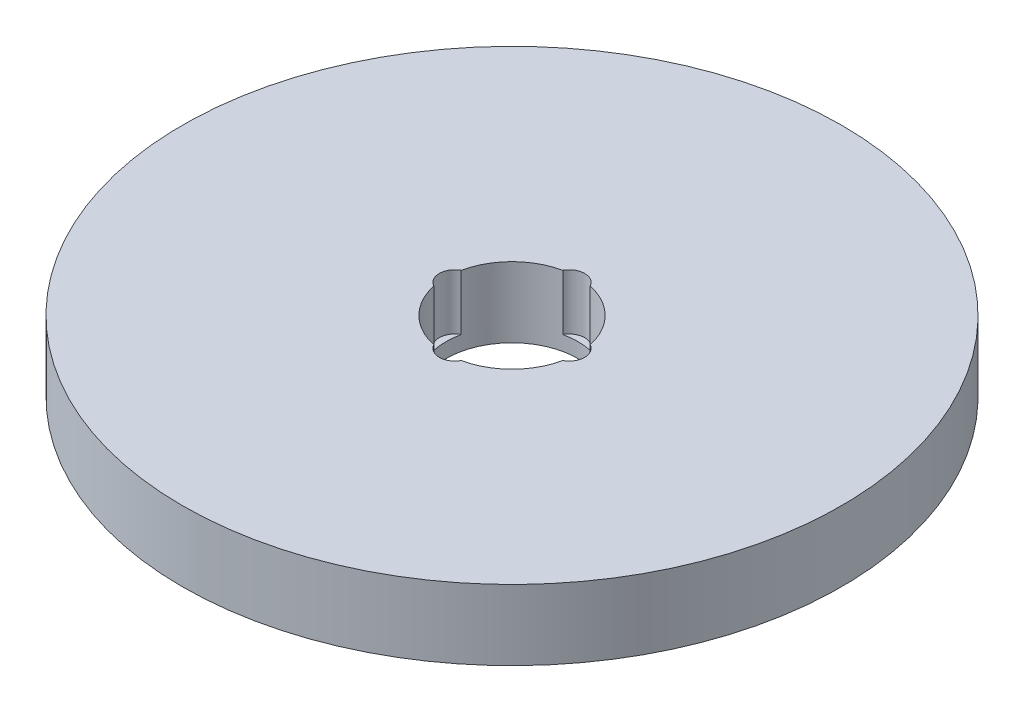
ISO-10303-21;
HEADER;
FILE_DESCRIPTION(('STEP AP214'),'2;1');
FILE_NAME('part.step','',(''),(''),'','','');
FILE_SCHEMA(('AUTOMOTIVE_DESIGN { 1 0 10303 214 1 1 1 1 }'));
ENDSEC;
DATA;
#1=APPLICATION_CONTEXT('core data for automotive mechanical design processes');
#2=APPLICATION_PROTOCOL_DEFINITION('international standard','automotive_design',2000,#1);
#3=PRODUCT_CONTEXT('',#1,'mechanical');
#4=PRODUCT('Part','Part','',(#3));
#5=PRODUCT_RELATED_PRODUCT_CATEGORY('part','',(#4));
#6=PRODUCT_DEFINITION_FORMATION('','',#4);
#7=PRODUCT_DEFINITION_CONTEXT('part definition',#1,'design');
#8=PRODUCT_DEFINITION('design','',#6,#7);
#9=PRODUCT_DEFINITION_SHAPE('','',#8);
#10=(LENGTH_UNIT() NAMED_UNIT(*) SI_UNIT(.MILLI.,.METRE.));
#11=(NAMED_UNIT(*) PLANE_ANGLE_UNIT() SI_UNIT($,.RADIAN.));
#12=(NAMED_UNIT(*) SI_UNIT($,.STERADIAN.) SOLID_ANGLE_UNIT());
#13=UNCERTAINTY_MEASURE_WITH_UNIT(LENGTH_MEASURE(1.E-05),#10,'distance_accuracy_value','');
#14=(GEOMETRIC_REPRESENTATION_CONTEXT(3) GLOBAL_UNCERTAINTY_ASSIGNED_CONTEXT((#13)) GLOBAL_UNIT_ASSIGNED_CONTEXT((#10,
#11,#12)) REPRESENTATION_CONTEXT('',''));
#15=CARTESIAN_POINT('',(0.,0.,0.));
#16=DIRECTION('',(0.,0.,1.));
#17=DIRECTION('',(1.,0.,0.));
#18=AXIS2_PLACEMENT_3D('',#15,#16,#17);
#19=CARTESIAN_POINT('',(0.,8.,0.));
#20=DIRECTION('',(0.,-1.,0.));
#21=DIRECTION('',(0.,0.,-1.));
#22=AXIS2_PLACEMENT_3D('',#19,#20,#21);
#23=CYLINDRICAL_SURFACE('',#22,37.5);
#24=CARTESIAN_POINT('',(0.,8.,0.));
#25=DIRECTION('',(0.,1.,0.));
#26=DIRECTION('',(0.,0.,1.));
#27=AXIS2_PLACEMENT_3D('',#24,#25,#26);
#28=CIRCLE('',#27,37.5);
#29=CARTESIAN_POINT('',(0.,8.,37.5));
#30=VERTEX_POINT('',#29);
#31=EDGE_CURVE('E148',#30,#30,#28,.T.);
#32=ORIENTED_EDGE('',*,*,#31,.F.);
#33=EDGE_LOOP('',(#32));
#34=FACE_BOUND('',#33,.T.);
#35=CARTESIAN_POINT('',(0.,0.,0.));
#36=DIRECTION('',(0.,1.,0.));
#37=DIRECTION('',(0.,0.,1.));
#38=AXIS2_PLACEMENT_3D('',#35,#36,#37);
#39=CIRCLE('',#38,37.5);
#40=CARTESIAN_POINT('',(0.,0.,37.5));
#41=VERTEX_POINT('',#40);
#42=EDGE_CURVE('E139',#41,#41,#39,.T.);
#43=ORIENTED_EDGE('',*,*,#42,.T.);
#44=EDGE_LOOP('',(#43));
#45=FACE_BOUND('',#44,.T.);
#46=ADVANCED_FACE('F39',(#34,#45),#23,.T.);
#47=CARTESIAN_POINT('',(0.,8.,0.));
#48=DIRECTION('',(0.,1.,0.));
#49=DIRECTION('',(0.,0.,1.));
#50=AXIS2_PLACEMENT_3D('',#47,#48,#49);
#51=PLANE('',#50);
#52=CARTESIAN_POINT('',(0.,8.,6.49927386332328));
#53=DIRECTION('',(0.,1.,0.));
#54=DIRECTION('',(1.,0.,0.));
#55=AXIS2_PLACEMENT_3D('',#52,#53,#54);
#56=CIRCLE('',#55,1.77006514991203);
#57=CARTESIAN_POINT('',(-1.55981062752104,8.,7.33600646171147));
#58=VERTEX_POINT('',#57);
#59=CARTESIAN_POINT('',(1.55981062752109,8.,7.33600646171146));
#60=VERTEX_POINT('',#59);
#61=EDGE_CURVE('E175',#58,#60,#56,.T.);
#62=ORIENTED_EDGE('',*,*,#61,.F.);
#63=CARTESIAN_POINT('',(0.,8.,0.));
#64=DIRECTION('',(0.,1.,0.));
#65=DIRECTION('',(0.,0.,1.));
#66=AXIS2_PLACEMENT_3D('',#63,#64,#65);
#67=CIRCLE('',#66,7.5);
#68=CARTESIAN_POINT('',(-7.33600646171146,8.,1.55981062752107));
#69=VERTEX_POINT('',#68);
#70=EDGE_CURVE('E134',#69,#58,#67,.T.);
#71=ORIENTED_EDGE('',*,*,#70,.F.);
#72=CARTESIAN_POINT('',(-6.49927386332328,8.,0.));
#73=DIRECTION('',(0.,1.,0.));
#74=DIRECTION('',(0.,0.,1.));
#75=AXIS2_PLACEMENT_3D('',#72,#73,#74);
#76=CIRCLE('',#75,1.77006514991203);
#77=CARTESIAN_POINT('',(-7.33600646171146,8.,-1.55981062752107));
#78=VERTEX_POINT('',#77);
#79=EDGE_CURVE('E143',#78,#69,#76,.T.);
#80=ORIENTED_EDGE('',*,*,#79,.F.);
#81=CARTESIAN_POINT('',(-1.55981062752114,8.,-7.33600646171145));
#82=VERTEX_POINT('',#81);
#83=EDGE_CURVE('E123',#82,#78,#67,.T.);
#84=ORIENTED_EDGE('',*,*,#83,.F.);
#85=CARTESIAN_POINT('',(0.,8.,-6.49927386332328));
#86=DIRECTION('',(0.,1.,0.));
#87=DIRECTION('',(-1.,0.,0.));
#88=AXIS2_PLACEMENT_3D('',#85,#86,#87);
#89=CIRCLE('',#88,1.77006514991203);
#90=CARTESIAN_POINT('',(1.55981062752099,8.,-7.33600646171148));
#91=VERTEX_POINT('',#90);
#92=EDGE_CURVE('E106',#91,#82,#89,.T.);
#93=ORIENTED_EDGE('',*,*,#92,.F.);
#94=CARTESIAN_POINT('',(7.33600646171146,8.,-1.55981062752107));
#95=VERTEX_POINT('',#94);
#96=EDGE_CURVE('E125',#95,#91,#67,.T.);
#97=ORIENTED_EDGE('',*,*,#96,.F.);
#98=CARTESIAN_POINT('',(6.49927386332328,8.,0.));
#99=DIRECTION('',(0.,1.,0.));
#100=DIRECTION('',(0.,0.,-1.));
#101=AXIS2_PLACEMENT_3D('',#98,#99,#100);
#102=CIRCLE('',#101,1.77006514991203);
#103=CARTESIAN_POINT('',(7.33600646171146,8.,1.55981062752107));
#104=VERTEX_POINT('',#103);
#105=EDGE_CURVE('E286',#104,#95,#102,.T.);
#106=ORIENTED_EDGE('',*,*,#105,.F.);
#107=EDGE_CURVE('E135',#60,#104,#67,.T.);
#108=ORIENTED_EDGE('',*,*,#107,.F.);
#109=EDGE_LOOP('',(#62,#71,#80,#84,#93,#97,#106,#108));
#110=FACE_BOUND('',#109,.T.);
#111=ORIENTED_EDGE('',*,*,#31,.T.);
#112=EDGE_LOOP('',(#111));
#113=FACE_BOUND('',#112,.T.);
#114=ADVANCED_FACE('F118',(#110,#113),#51,.T.);
#115=CARTESIAN_POINT('',(0.,0.,0.));
#116=DIRECTION('',(0.,1.,0.));
#117=DIRECTION('',(0.,0.,1.));
#118=AXIS2_PLACEMENT_3D('',#115,#116,#117);
#119=PLANE('',#118);
#120=CARTESIAN_POINT('',(0.,0.,0.));
#121=DIRECTION('',(0.,1.,0.));
#122=DIRECTION('',(0.,0.,1.));
#123=AXIS2_PLACEMENT_3D('',#120,#121,#122);
#124=CIRCLE('',#123,7.5);
#125=CARTESIAN_POINT('',(0.,0.,7.5));
#126=VERTEX_POINT('',#125);
#127=EDGE_CURVE('E136',#126,#126,#124,.T.);
#128=ORIENTED_EDGE('',*,*,#127,.T.);
#129=EDGE_LOOP('',(#128));
#130=FACE_BOUND('',#129,.T.);
#131=ORIENTED_EDGE('',*,*,#42,.F.);
#132=EDGE_LOOP('',(#131));
#133=FACE_BOUND('',#132,.T.);
#134=ADVANCED_FACE('F187',(#130,#133),#119,.F.);
#135=CARTESIAN_POINT('',(0.,8.,0.));
#136=DIRECTION('',(0.,-1.,0.));
#137=DIRECTION('',(0.,0.,-1.));
#138=AXIS2_PLACEMENT_3D('',#135,#136,#137);
#139=CYLINDRICAL_SURFACE('',#138,7.5);
#140=DIRECTION('',(0.,1.,0.));
#141=VECTOR('',#140,1.);
#142=CARTESIAN_POINT('',(-1.55981062752104,4.83446331469937,7.33600646171147));
#143=LINE('',#142,#141);
#144=CARTESIAN_POINT('',(-1.55981062752104,1.66892662939874,7.33600646171147));
#145=VERTEX_POINT('',#144);
#146=EDGE_CURVE('E11',#145,#58,#143,.T.);
#147=ORIENTED_EDGE('',*,*,#146,.F.);
#148=CARTESIAN_POINT('',(0.,1.66892662939874,0.));
#149=DIRECTION('',(0.,1.,0.));
#150=DIRECTION('',(0.,0.,1.));
#151=AXIS2_PLACEMENT_3D('',#148,#149,#150);
#152=CIRCLE('',#151,7.5);
#153=CARTESIAN_POINT('',(1.55981062752109,1.66892662939874,7.33600646171146));
#154=VERTEX_POINT('',#153);
#155=EDGE_CURVE('E170',#145,#154,#152,.T.);
#156=ORIENTED_EDGE('',*,*,#155,.T.);
#157=DIRECTION('',(0.,1.,0.));
#158=VECTOR('',#157,1.);
#159=CARTESIAN_POINT('',(1.55981062752109,4.83446331469937,7.33600646171146));
#160=LINE('',#159,#158);
#161=EDGE_CURVE('E46',#60,#154,#160,.F.);
#162=ORIENTED_EDGE('',*,*,#161,.F.);
#163=ORIENTED_EDGE('',*,*,#107,.T.);
#164=DIRECTION('',(0.,1.,0.));
#165=VECTOR('',#164,1.);
#166=CARTESIAN_POINT('',(7.33600646171146,4.83446331469937,1.55981062752107));
#167=LINE('',#166,#165);
#168=CARTESIAN_POINT('',(7.33600646171146,1.66892662939874,1.55981062752107));
#169=VERTEX_POINT('',#168);
#170=EDGE_CURVE('E164',#169,#104,#167,.T.);
#171=ORIENTED_EDGE('',*,*,#170,.F.);
#172=CARTESIAN_POINT('',(0.,1.66892662939874,0.));
#173=DIRECTION('',(0.,1.,0.));
#174=DIRECTION('',(0.,0.,1.));
#175=AXIS2_PLACEMENT_3D('',#172,#173,#174);
#176=CIRCLE('',#175,7.5);
#177=CARTESIAN_POINT('',(7.33600646171146,1.66892662939874,-1.55981062752107));
#178=VERTEX_POINT('',#177);
#179=EDGE_CURVE('E115',#169,#178,#176,.T.);
#180=ORIENTED_EDGE('',*,*,#179,.T.);
#181=DIRECTION('',(0.,1.,0.));
#182=VECTOR('',#181,1.);
#183=CARTESIAN_POINT('',(7.33600646171146,4.83446331469937,-1.55981062752107));
#184=LINE('',#183,#182);
#185=EDGE_CURVE('E131',#95,#178,#184,.F.);
#186=ORIENTED_EDGE('',*,*,#185,.F.);
#187=ORIENTED_EDGE('',*,*,#96,.T.);
#188=DIRECTION('',(0.,1.,0.));
#189=VECTOR('',#188,1.);
#190=CARTESIAN_POINT('',(1.55981062752099,4.83446331469937,-7.33600646171148));
#191=LINE('',#190,#189);
#192=CARTESIAN_POINT('',(1.55981062752099,1.66892662939874,-7.33600646171148));
#193=VERTEX_POINT('',#192);
#194=EDGE_CURVE('E105',#193,#91,#191,.T.);
#195=ORIENTED_EDGE('',*,*,#194,.F.);
#196=CARTESIAN_POINT('',(0.,1.66892662939874,0.));
#197=DIRECTION('',(0.,1.,0.));
#198=DIRECTION('',(0.,0.,1.));
#199=AXIS2_PLACEMENT_3D('',#196,#197,#198);
#200=CIRCLE('',#199,7.5);
#201=CARTESIAN_POINT('',(-1.55981062752114,1.66892662939874,-7.33600646171145));
#202=VERTEX_POINT('',#201);
#203=EDGE_CURVE('E159',#193,#202,#200,.T.);
#204=ORIENTED_EDGE('',*,*,#203,.T.);
#205=DIRECTION('',(0.,1.,0.));
#206=VECTOR('',#205,1.);
#207=CARTESIAN_POINT('',(-1.55981062752114,4.83446331469937,-7.33600646171145));
#208=LINE('',#207,#206);
#209=EDGE_CURVE('E114',#82,#202,#208,.F.);
#210=ORIENTED_EDGE('',*,*,#209,.F.);
#211=ORIENTED_EDGE('',*,*,#83,.T.);
#212=DIRECTION('',(0.,1.,0.));
#213=VECTOR('',#212,1.);
#214=CARTESIAN_POINT('',(-7.33600646171146,4.83446331469937,-1.55981062752107));
#215=LINE('',#214,#213);
#216=CARTESIAN_POINT('',(-7.33600646171146,1.66892662939874,-1.55981062752107));
#217=VERTEX_POINT('',#216);
#218=EDGE_CURVE('E160',#217,#78,#215,.T.);
#219=ORIENTED_EDGE('',*,*,#218,.F.);
#220=CARTESIAN_POINT('',(0.,1.66892662939874,0.));
#221=DIRECTION('',(0.,1.,0.));
#222=DIRECTION('',(0.,0.,1.));
#223=AXIS2_PLACEMENT_3D('',#220,#221,#222);
#224=CIRCLE('',#223,7.5);
#225=CARTESIAN_POINT('',(-7.33600646171146,1.66892662939874,1.55981062752107));
#226=VERTEX_POINT('',#225);
#227=EDGE_CURVE('E149',#217,#226,#224,.T.);
#228=ORIENTED_EDGE('',*,*,#227,.T.);
#229=DIRECTION('',(0.,1.,0.));
#230=VECTOR('',#229,1.);
#231=CARTESIAN_POINT('',(-7.33600646171146,4.83446331469937,1.55981062752107));
#232=LINE('',#231,#230);
#233=EDGE_CURVE('E152',#69,#226,#232,.F.);
#234=ORIENTED_EDGE('',*,*,#233,.F.);
#235=ORIENTED_EDGE('',*,*,#70,.T.);
#236=EDGE_LOOP('',(#147,#156,#162,#163,#171,#180,#186,#187,#195,#204,#210,#211,#219,#228,#234,#235));
#237=FACE_BOUND('',#236,.T.);
#238=ORIENTED_EDGE('',*,*,#127,.F.);
#239=EDGE_LOOP('',(#238));
#240=FACE_BOUND('',#239,.T.);
#241=ADVANCED_FACE('F126',(#237,#240),#139,.F.);
#242=CARTESIAN_POINT('',(-6.49927386332328,1.66892662939874,0.));
#243=DIRECTION('',(0.,1.,0.));
#244=DIRECTION('',(0.,0.,1.));
#245=AXIS2_PLACEMENT_3D('',#242,#243,#244);
#246=CYLINDRICAL_SURFACE('',#245,1.77006514991203);
#247=ORIENTED_EDGE('',*,*,#218,.T.);
#248=ORIENTED_EDGE('',*,*,#79,.T.);
#249=ORIENTED_EDGE('',*,*,#233,.T.);
#250=CARTESIAN_POINT('',(-6.49927386332328,1.66892662939874,0.));
#251=DIRECTION('',(0.,1.,0.));
#252=DIRECTION('',(0.,0.,1.));
#253=AXIS2_PLACEMENT_3D('',#250,#251,#252);
#254=CIRCLE('',#253,1.77006514991203);
#255=EDGE_CURVE('E144',#217,#226,#254,.T.);
#256=ORIENTED_EDGE('',*,*,#255,.F.);
#257=EDGE_LOOP('',(#247,#248,#249,#256));
#258=FACE_BOUND('',#257,.T.);
#259=ADVANCED_FACE('F200',(#258),#246,.F.);
#260=CARTESIAN_POINT('',(-6.49927386332328,1.66892662939874,0.));
#261=DIRECTION('',(0.,1.,0.));
#262=DIRECTION('',(0.,0.,1.));
#263=AXIS2_PLACEMENT_3D('',#260,#261,#262);
#264=PLANE('',#263);
#265=ORIENTED_EDGE('',*,*,#255,.T.);
#266=ORIENTED_EDGE('',*,*,#227,.F.);
#267=EDGE_LOOP('',(#265,#266));
#268=FACE_BOUND('',#267,.T.);
#269=ADVANCED_FACE('F201',(#268),#264,.T.);
#270=CARTESIAN_POINT('',(0.,1.66892662939874,-6.49927386332328));
#271=DIRECTION('',(0.,1.,0.));
#272=DIRECTION('',(0.,0.,1.));
#273=AXIS2_PLACEMENT_3D('',#270,#271,#272);
#274=CYLINDRICAL_SURFACE('',#273,1.77006514991203);
#275=ORIENTED_EDGE('',*,*,#194,.T.);
#276=ORIENTED_EDGE('',*,*,#92,.T.);
#277=ORIENTED_EDGE('',*,*,#209,.T.);
#278=CARTESIAN_POINT('',(0.,1.66892662939874,-6.49927386332328));
#279=DIRECTION('',(0.,1.,0.));
#280=DIRECTION('',(-1.,0.,0.));
#281=AXIS2_PLACEMENT_3D('',#278,#279,#280);
#282=CIRCLE('',#281,1.77006514991203);
#283=EDGE_CURVE('E107',#193,#202,#282,.T.);
#284=ORIENTED_EDGE('',*,*,#283,.F.);
#285=EDGE_LOOP('',(#275,#276,#277,#284));
#286=FACE_BOUND('',#285,.T.);
#287=ADVANCED_FACE('F102',(#286),#274,.F.);
#288=CARTESIAN_POINT('',(0.,1.66892662939874,-6.49927386332328));
#289=DIRECTION('',(0.,1.,0.));
#290=DIRECTION('',(-1.,0.,0.));
#291=AXIS2_PLACEMENT_3D('',#288,#289,#290);
#292=PLANE('',#291);
#293=ORIENTED_EDGE('',*,*,#283,.T.);
#294=ORIENTED_EDGE('',*,*,#203,.F.);
#295=EDGE_LOOP('',(#293,#294));
#296=FACE_BOUND('',#295,.T.);
#297=ADVANCED_FACE('F209',(#296),#292,.T.);
#298=CARTESIAN_POINT('',(6.49927386332328,1.66892662939874,0.));
#299=DIRECTION('',(0.,1.,0.));
#300=DIRECTION('',(0.,0.,1.));
#301=AXIS2_PLACEMENT_3D('',#298,#299,#300);
#302=CYLINDRICAL_SURFACE('',#301,1.77006514991203);
#303=ORIENTED_EDGE('',*,*,#170,.T.);
#304=ORIENTED_EDGE('',*,*,#105,.T.);
#305=ORIENTED_EDGE('',*,*,#185,.T.);
#306=CARTESIAN_POINT('',(6.49927386332328,1.66892662939874,0.));
#307=DIRECTION('',(0.,1.,0.));
#308=DIRECTION('',(0.,0.,-1.));
#309=AXIS2_PLACEMENT_3D('',#306,#307,#308);
#310=CIRCLE('',#309,1.77006514991203);
#311=EDGE_CURVE('E56',#169,#178,#310,.T.);
#312=ORIENTED_EDGE('',*,*,#311,.F.);
#313=EDGE_LOOP('',(#303,#304,#305,#312));
#314=FACE_BOUND('',#313,.T.);
#315=ADVANCED_FACE('F213',(#314),#302,.F.);
#316=CARTESIAN_POINT('',(6.49927386332328,1.66892662939874,0.));
#317=DIRECTION('',(0.,1.,0.));
#318=DIRECTION('',(0.,0.,-1.));
#319=AXIS2_PLACEMENT_3D('',#316,#317,#318);
#320=PLANE('',#319);
#321=ORIENTED_EDGE('',*,*,#311,.T.);
#322=ORIENTED_EDGE('',*,*,#179,.F.);
#323=EDGE_LOOP('',(#321,#322));
#324=FACE_BOUND('',#323,.T.);
#325=ADVANCED_FACE('F179',(#324),#320,.T.);
#326=CARTESIAN_POINT('',(0.,1.66892662939874,6.49927386332328));
#327=DIRECTION('',(0.,1.,0.));
#328=DIRECTION('',(0.,0.,1.));
#329=AXIS2_PLACEMENT_3D('',#326,#327,#328);
#330=CYLINDRICAL_SURFACE('',#329,1.77006514991203);
#331=ORIENTED_EDGE('',*,*,#146,.T.);
#332=ORIENTED_EDGE('',*,*,#61,.T.);
#333=ORIENTED_EDGE('',*,*,#161,.T.);
#334=CARTESIAN_POINT('',(0.,1.66892662939874,6.49927386332328));
#335=DIRECTION('',(0.,1.,0.));
#336=DIRECTION('',(1.,0.,0.));
#337=AXIS2_PLACEMENT_3D('',#334,#335,#336);
#338=CIRCLE('',#337,1.77006514991203);
#339=EDGE_CURVE('E55',#145,#154,#338,.T.);
#340=ORIENTED_EDGE('',*,*,#339,.F.);
#341=EDGE_LOOP('',(#331,#332,#333,#340));
#342=FACE_BOUND('',#341,.T.);
#343=ADVANCED_FACE('F171',(#342),#330,.F.);
#344=CARTESIAN_POINT('',(0.,1.66892662939874,6.49927386332328));
#345=DIRECTION('',(0.,1.,0.));
#346=DIRECTION('',(1.,0.,0.));
#347=AXIS2_PLACEMENT_3D('',#344,#345,#346);
#348=PLANE('',#347);
#349=ORIENTED_EDGE('',*,*,#339,.T.);
#350=ORIENTED_EDGE('',*,*,#155,.F.);
#351=EDGE_LOOP('',(#349,#350));
#352=FACE_BOUND('',#351,.T.);
#353=ADVANCED_FACE('F173',(#352),#348,.T.);
#354=CLOSED_SHELL('',(#46,#114,#134,#241,#259,#269,#287,#297,#315,#325,#343,#353));
#355=MANIFOLD_SOLID_BREP('B2',#354);
#356=ADVANCED_BREP_SHAPE_REPRESENTATION('',(#18,#355),#14);
#357=SHAPE_DEFINITION_REPRESENTATION(#9,#356);
ENDSEC;
END-ISO-10303-21;
